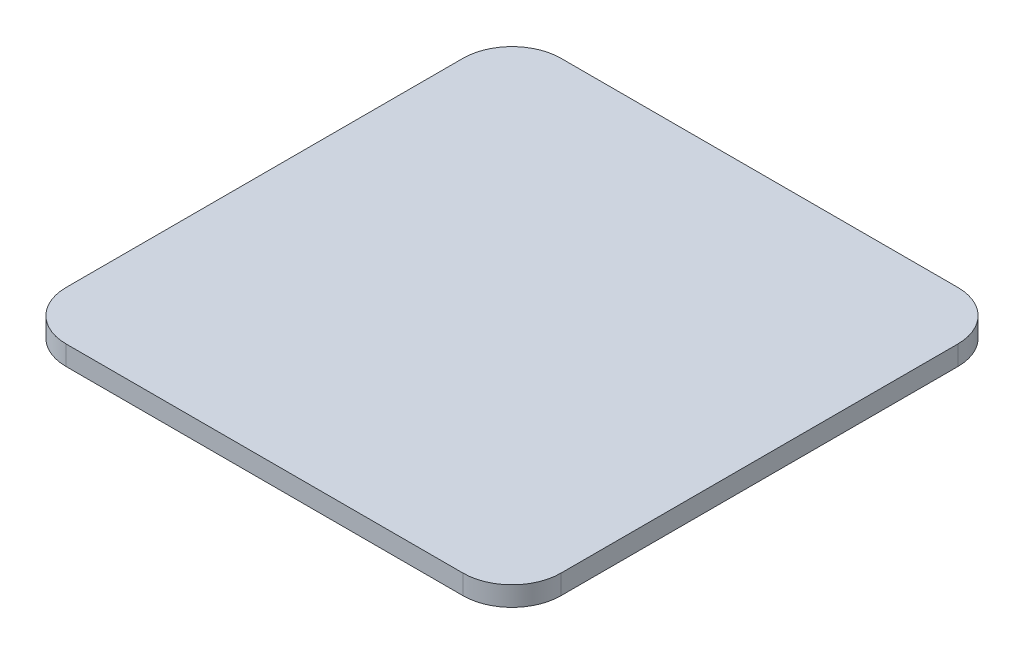
ISO-10303-21;
HEADER;
FILE_DESCRIPTION(('STEP AP214'),'2;1');
FILE_NAME('part.step','',(''),(''),'','','');
FILE_SCHEMA(('AUTOMOTIVE_DESIGN { 1 0 10303 214 1 1 1 1 }'));
ENDSEC;
DATA;
#1=APPLICATION_CONTEXT('core data for automotive mechanical design processes');
#2=APPLICATION_PROTOCOL_DEFINITION('international standard','automotive_design',2000,#1);
#3=PRODUCT_CONTEXT('',#1,'mechanical');
#4=PRODUCT('Part','Part','',(#3));
#5=PRODUCT_RELATED_PRODUCT_CATEGORY('part','',(#4));
#6=PRODUCT_DEFINITION_FORMATION('','',#4);
#7=PRODUCT_DEFINITION_CONTEXT('part definition',#1,'design');
#8=PRODUCT_DEFINITION('design','',#6,#7);
#9=PRODUCT_DEFINITION_SHAPE('','',#8);
#10=(LENGTH_UNIT() NAMED_UNIT(*) SI_UNIT(.MILLI.,.METRE.));
#11=(NAMED_UNIT(*) PLANE_ANGLE_UNIT() SI_UNIT($,.RADIAN.));
#12=(NAMED_UNIT(*) SI_UNIT($,.STERADIAN.) SOLID_ANGLE_UNIT());
#13=UNCERTAINTY_MEASURE_WITH_UNIT(LENGTH_MEASURE(1.E-05),#10,'distance_accuracy_value','');
#14=(GEOMETRIC_REPRESENTATION_CONTEXT(3) GLOBAL_UNCERTAINTY_ASSIGNED_CONTEXT((#13)) GLOBAL_UNIT_ASSIGNED_CONTEXT((#10,
#11,#12)) REPRESENTATION_CONTEXT('',''));
#15=CARTESIAN_POINT('',(0.,0.,0.));
#16=DIRECTION('',(0.,0.,1.));
#17=DIRECTION('',(1.,0.,0.));
#18=AXIS2_PLACEMENT_3D('',#15,#16,#17);
#19=CARTESIAN_POINT('',(-20.25,2.,20.25));
#20=DIRECTION('',(0.,-1.,0.));
#21=DIRECTION('',(0.,0.,-1.));
#22=AXIS2_PLACEMENT_3D('',#19,#20,#21);
#23=CYLINDRICAL_SURFACE('',#22,5.);
#24=CARTESIAN_POINT('',(-20.25,0.,20.25));
#25=DIRECTION('',(0.,1.,0.));
#26=DIRECTION('',(0.,0.,-1.));
#27=AXIS2_PLACEMENT_3D('',#24,#25,#26);
#28=CIRCLE('',#27,5.);
#29=CARTESIAN_POINT('',(-25.25,0.,20.25));
#30=VERTEX_POINT('',#29);
#31=CARTESIAN_POINT('',(-20.25,0.,25.25));
#32=VERTEX_POINT('',#31);
#33=EDGE_CURVE('E135',#30,#32,#28,.T.);
#34=ORIENTED_EDGE('',*,*,#33,.T.);
#35=DIRECTION('',(0.,-1.,0.));
#36=VECTOR('',#35,1.);
#37=CARTESIAN_POINT('',(-20.25,2.,25.25));
#38=LINE('',#37,#36);
#39=CARTESIAN_POINT('',(-20.25,2.,25.25));
#40=VERTEX_POINT('',#39);
#41=EDGE_CURVE('E11',#40,#32,#38,.T.);
#42=ORIENTED_EDGE('',*,*,#41,.F.);
#43=CARTESIAN_POINT('',(-20.25,2.,20.25));
#44=DIRECTION('',(0.,1.,0.));
#45=DIRECTION('',(0.,0.,-1.));
#46=AXIS2_PLACEMENT_3D('',#43,#44,#45);
#47=CIRCLE('',#46,5.);
#48=CARTESIAN_POINT('',(-25.25,2.,20.25));
#49=VERTEX_POINT('',#48);
#50=EDGE_CURVE('E149',#49,#40,#47,.T.);
#51=ORIENTED_EDGE('',*,*,#50,.F.);
#52=DIRECTION('',(0.,-1.,0.));
#53=VECTOR('',#52,1.);
#54=CARTESIAN_POINT('',(-25.25,2.,20.25));
#55=LINE('',#54,#53);
#56=EDGE_CURVE('E131',#49,#30,#55,.T.);
#57=ORIENTED_EDGE('',*,*,#56,.T.);
#58=EDGE_LOOP('',(#34,#42,#51,#57));
#59=FACE_BOUND('',#58,.T.);
#60=ADVANCED_FACE('F39',(#59),#23,.T.);
#61=CARTESIAN_POINT('',(-20.25,2.,25.25));
#62=DIRECTION('',(0.,0.,-1.));
#63=DIRECTION('',(-1.,0.,0.));
#64=AXIS2_PLACEMENT_3D('',#61,#62,#63);
#65=PLANE('',#64);
#66=DIRECTION('',(1.,0.,0.));
#67=VECTOR('',#66,1.);
#68=CARTESIAN_POINT('',(-20.25,0.,25.25));
#69=LINE('',#68,#67);
#70=CARTESIAN_POINT('',(20.25,0.,25.25));
#71=VERTEX_POINT('',#70);
#72=EDGE_CURVE('E138',#32,#71,#69,.T.);
#73=ORIENTED_EDGE('',*,*,#72,.T.);
#74=DIRECTION('',(0.,-1.,0.));
#75=VECTOR('',#74,1.);
#76=CARTESIAN_POINT('',(20.25,2.,25.25));
#77=LINE('',#76,#75);
#78=CARTESIAN_POINT('',(20.25,2.,25.25));
#79=VERTEX_POINT('',#78);
#80=EDGE_CURVE('E47',#79,#71,#77,.T.);
#81=ORIENTED_EDGE('',*,*,#80,.F.);
#82=DIRECTION('',(1.,0.,0.));
#83=VECTOR('',#82,1.);
#84=CARTESIAN_POINT('',(-20.25,2.,25.25));
#85=LINE('',#84,#83);
#86=EDGE_CURVE('E98',#40,#79,#85,.T.);
#87=ORIENTED_EDGE('',*,*,#86,.F.);
#88=ORIENTED_EDGE('',*,*,#41,.T.);
#89=EDGE_LOOP('',(#73,#81,#87,#88));
#90=FACE_BOUND('',#89,.T.);
#91=ADVANCED_FACE('F184',(#90),#65,.F.);
#92=CARTESIAN_POINT('',(20.25,2.,20.25));
#93=DIRECTION('',(0.,-1.,0.));
#94=DIRECTION('',(0.,0.,-1.));
#95=AXIS2_PLACEMENT_3D('',#92,#93,#94);
#96=CYLINDRICAL_SURFACE('',#95,5.);
#97=CARTESIAN_POINT('',(20.25,0.,20.25));
#98=DIRECTION('',(0.,1.,0.));
#99=DIRECTION('',(0.,0.,1.));
#100=AXIS2_PLACEMENT_3D('',#97,#98,#99);
#101=CIRCLE('',#100,5.);
#102=CARTESIAN_POINT('',(25.25,0.,20.25));
#103=VERTEX_POINT('',#102);
#104=EDGE_CURVE('E140',#71,#103,#101,.T.);
#105=ORIENTED_EDGE('',*,*,#104,.T.);
#106=DIRECTION('',(0.,-1.,0.));
#107=VECTOR('',#106,1.);
#108=CARTESIAN_POINT('',(25.25,2.,20.25));
#109=LINE('',#108,#107);
#110=CARTESIAN_POINT('',(25.25,2.,20.25));
#111=VERTEX_POINT('',#110);
#112=EDGE_CURVE('E156',#111,#103,#109,.T.);
#113=ORIENTED_EDGE('',*,*,#112,.F.);
#114=CARTESIAN_POINT('',(20.25,2.,20.25));
#115=DIRECTION('',(0.,1.,0.));
#116=DIRECTION('',(0.,0.,1.));
#117=AXIS2_PLACEMENT_3D('',#114,#115,#116);
#118=CIRCLE('',#117,5.);
#119=EDGE_CURVE('E164',#79,#111,#118,.T.);
#120=ORIENTED_EDGE('',*,*,#119,.F.);
#121=ORIENTED_EDGE('',*,*,#80,.T.);
#122=EDGE_LOOP('',(#105,#113,#120,#121));
#123=FACE_BOUND('',#122,.T.);
#124=ADVANCED_FACE('F162',(#123),#96,.T.);
#125=CARTESIAN_POINT('',(25.25,2.,-20.25));
#126=DIRECTION('',(-1.,0.,0.));
#127=DIRECTION('',(0.,0.,1.));
#128=AXIS2_PLACEMENT_3D('',#125,#126,#127);
#129=PLANE('',#128);
#130=DIRECTION('',(0.,0.,-1.));
#131=VECTOR('',#130,1.);
#132=CARTESIAN_POINT('',(25.25,0.,-20.25));
#133=LINE('',#132,#131);
#134=CARTESIAN_POINT('',(25.25,0.,-20.25));
#135=VERTEX_POINT('',#134);
#136=EDGE_CURVE('E142',#103,#135,#133,.T.);
#137=ORIENTED_EDGE('',*,*,#136,.T.);
#138=DIRECTION('',(0.,-1.,0.));
#139=VECTOR('',#138,1.);
#140=CARTESIAN_POINT('',(25.25,2.,-20.25));
#141=LINE('',#140,#139);
#142=CARTESIAN_POINT('',(25.25,2.,-20.25));
#143=VERTEX_POINT('',#142);
#144=EDGE_CURVE('E153',#143,#135,#141,.T.);
#145=ORIENTED_EDGE('',*,*,#144,.F.);
#146=DIRECTION('',(0.,0.,-1.));
#147=VECTOR('',#146,1.);
#148=CARTESIAN_POINT('',(25.25,2.,-20.25));
#149=LINE('',#148,#147);
#150=EDGE_CURVE('E176',#111,#143,#149,.T.);
#151=ORIENTED_EDGE('',*,*,#150,.F.);
#152=ORIENTED_EDGE('',*,*,#112,.T.);
#153=EDGE_LOOP('',(#137,#145,#151,#152));
#154=FACE_BOUND('',#153,.T.);
#155=ADVANCED_FACE('F172',(#154),#129,.F.);
#156=CARTESIAN_POINT('',(20.25,2.,-20.25));
#157=DIRECTION('',(0.,-1.,0.));
#158=DIRECTION('',(0.,0.,-1.));
#159=AXIS2_PLACEMENT_3D('',#156,#157,#158);
#160=CYLINDRICAL_SURFACE('',#159,5.);
#161=CARTESIAN_POINT('',(20.25,0.,-20.25));
#162=DIRECTION('',(0.,1.,0.));
#163=DIRECTION('',(0.,0.,1.));
#164=AXIS2_PLACEMENT_3D('',#161,#162,#163);
#165=CIRCLE('',#164,5.);
#166=CARTESIAN_POINT('',(20.25,0.,-25.25));
#167=VERTEX_POINT('',#166);
#168=EDGE_CURVE('E144',#135,#167,#165,.T.);
#169=ORIENTED_EDGE('',*,*,#168,.T.);
#170=DIRECTION('',(0.,-1.,0.));
#171=VECTOR('',#170,1.);
#172=CARTESIAN_POINT('',(20.25,2.,-25.25));
#173=LINE('',#172,#171);
#174=CARTESIAN_POINT('',(20.25,2.,-25.25));
#175=VERTEX_POINT('',#174);
#176=EDGE_CURVE('E126',#175,#167,#173,.T.);
#177=ORIENTED_EDGE('',*,*,#176,.F.);
#178=CARTESIAN_POINT('',(20.25,2.,-20.25));
#179=DIRECTION('',(0.,1.,0.));
#180=DIRECTION('',(0.,0.,1.));
#181=AXIS2_PLACEMENT_3D('',#178,#179,#180);
#182=CIRCLE('',#181,5.);
#183=EDGE_CURVE('E117',#143,#175,#182,.T.);
#184=ORIENTED_EDGE('',*,*,#183,.F.);
#185=ORIENTED_EDGE('',*,*,#144,.T.);
#186=EDGE_LOOP('',(#169,#177,#184,#185));
#187=FACE_BOUND('',#186,.T.);
#188=ADVANCED_FACE('F175',(#187),#160,.T.);
#189=CARTESIAN_POINT('',(-20.25,2.,-25.25));
#190=DIRECTION('',(0.,0.,1.));
#191=DIRECTION('',(1.,0.,0.));
#192=AXIS2_PLACEMENT_3D('',#189,#190,#191);
#193=PLANE('',#192);
#194=DIRECTION('',(-1.,0.,0.));
#195=VECTOR('',#194,1.);
#196=CARTESIAN_POINT('',(-20.25,0.,-25.25));
#197=LINE('',#196,#195);
#198=CARTESIAN_POINT('',(-20.25,0.,-25.25));
#199=VERTEX_POINT('',#198);
#200=EDGE_CURVE('E125',#167,#199,#197,.T.);
#201=ORIENTED_EDGE('',*,*,#200,.T.);
#202=DIRECTION('',(0.,-1.,0.));
#203=VECTOR('',#202,1.);
#204=CARTESIAN_POINT('',(-20.25,2.,-25.25));
#205=LINE('',#204,#203);
#206=CARTESIAN_POINT('',(-20.25,2.,-25.25));
#207=VERTEX_POINT('',#206);
#208=EDGE_CURVE('E122',#207,#199,#205,.T.);
#209=ORIENTED_EDGE('',*,*,#208,.F.);
#210=DIRECTION('',(-1.,0.,0.));
#211=VECTOR('',#210,1.);
#212=CARTESIAN_POINT('',(-20.25,2.,-25.25));
#213=LINE('',#212,#211);
#214=EDGE_CURVE('E111',#175,#207,#213,.T.);
#215=ORIENTED_EDGE('',*,*,#214,.F.);
#216=ORIENTED_EDGE('',*,*,#176,.T.);
#217=EDGE_LOOP('',(#201,#209,#215,#216));
#218=FACE_BOUND('',#217,.T.);
#219=ADVANCED_FACE('F123',(#218),#193,.F.);
#220=CARTESIAN_POINT('',(-20.25,2.,-20.25));
#221=DIRECTION('',(0.,-1.,0.));
#222=DIRECTION('',(0.,0.,-1.));
#223=AXIS2_PLACEMENT_3D('',#220,#221,#222);
#224=CYLINDRICAL_SURFACE('',#223,5.);
#225=CARTESIAN_POINT('',(-20.25,0.,-20.25));
#226=DIRECTION('',(0.,1.,0.));
#227=DIRECTION('',(0.,0.,1.));
#228=AXIS2_PLACEMENT_3D('',#225,#226,#227);
#229=CIRCLE('',#228,5.);
#230=CARTESIAN_POINT('',(-25.25,0.,-20.25));
#231=VERTEX_POINT('',#230);
#232=EDGE_CURVE('E84',#199,#231,#229,.T.);
#233=ORIENTED_EDGE('',*,*,#232,.T.);
#234=DIRECTION('',(0.,-1.,0.));
#235=VECTOR('',#234,1.);
#236=CARTESIAN_POINT('',(-25.25,2.,-20.25));
#237=LINE('',#236,#235);
#238=CARTESIAN_POINT('',(-25.25,2.,-20.25));
#239=VERTEX_POINT('',#238);
#240=EDGE_CURVE('E127',#239,#231,#237,.T.);
#241=ORIENTED_EDGE('',*,*,#240,.F.);
#242=CARTESIAN_POINT('',(-20.25,2.,-20.25));
#243=DIRECTION('',(0.,1.,0.));
#244=DIRECTION('',(0.,0.,1.));
#245=AXIS2_PLACEMENT_3D('',#242,#243,#244);
#246=CIRCLE('',#245,5.);
#247=EDGE_CURVE('E115',#207,#239,#246,.T.);
#248=ORIENTED_EDGE('',*,*,#247,.F.);
#249=ORIENTED_EDGE('',*,*,#208,.T.);
#250=EDGE_LOOP('',(#233,#241,#248,#249));
#251=FACE_BOUND('',#250,.T.);
#252=ADVANCED_FACE('F129',(#251),#224,.T.);
#253=CARTESIAN_POINT('',(-25.25,2.,-20.25));
#254=DIRECTION('',(1.,0.,0.));
#255=DIRECTION('',(0.,0.,-1.));
#256=AXIS2_PLACEMENT_3D('',#253,#254,#255);
#257=PLANE('',#256);
#258=DIRECTION('',(0.,0.,1.));
#259=VECTOR('',#258,1.);
#260=CARTESIAN_POINT('',(-25.25,0.,-20.25));
#261=LINE('',#260,#259);
#262=EDGE_CURVE('E90',#231,#30,#261,.T.);
#263=ORIENTED_EDGE('',*,*,#262,.T.);
#264=ORIENTED_EDGE('',*,*,#56,.F.);
#265=DIRECTION('',(0.,0.,1.));
#266=VECTOR('',#265,1.);
#267=CARTESIAN_POINT('',(-25.25,2.,-20.25));
#268=LINE('',#267,#266);
#269=EDGE_CURVE('E55',#239,#49,#268,.T.);
#270=ORIENTED_EDGE('',*,*,#269,.F.);
#271=ORIENTED_EDGE('',*,*,#240,.T.);
#272=EDGE_LOOP('',(#263,#264,#270,#271));
#273=FACE_BOUND('',#272,.T.);
#274=ADVANCED_FACE('F200',(#273),#257,.F.);
#275=CARTESIAN_POINT('',(-20.25,2.,20.25));
#276=DIRECTION('',(0.,-1.,0.));
#277=DIRECTION('',(0.,0.,-1.));
#278=AXIS2_PLACEMENT_3D('',#275,#276,#277);
#279=PLANE('',#278);
#280=ORIENTED_EDGE('',*,*,#50,.T.);
#281=ORIENTED_EDGE('',*,*,#86,.T.);
#282=ORIENTED_EDGE('',*,*,#119,.T.);
#283=ORIENTED_EDGE('',*,*,#150,.T.);
#284=ORIENTED_EDGE('',*,*,#183,.T.);
#285=ORIENTED_EDGE('',*,*,#214,.T.);
#286=ORIENTED_EDGE('',*,*,#247,.T.);
#287=ORIENTED_EDGE('',*,*,#269,.T.);
#288=EDGE_LOOP('',(#280,#281,#282,#283,#284,#285,#286,#287));
#289=FACE_BOUND('',#288,.T.);
#290=ADVANCED_FACE('F113',(#289),#279,.F.);
#291=CARTESIAN_POINT('',(-20.25,0.,20.25));
#292=DIRECTION('',(0.,-1.,0.));
#293=DIRECTION('',(0.,0.,-1.));
#294=AXIS2_PLACEMENT_3D('',#291,#292,#293);
#295=PLANE('',#294);
#296=ORIENTED_EDGE('',*,*,#33,.F.);
#297=ORIENTED_EDGE('',*,*,#262,.F.);
#298=ORIENTED_EDGE('',*,*,#232,.F.);
#299=ORIENTED_EDGE('',*,*,#200,.F.);
#300=ORIENTED_EDGE('',*,*,#168,.F.);
#301=ORIENTED_EDGE('',*,*,#136,.F.);
#302=ORIENTED_EDGE('',*,*,#104,.F.);
#303=ORIENTED_EDGE('',*,*,#72,.F.);
#304=EDGE_LOOP('',(#296,#297,#298,#299,#300,#301,#302,#303));
#305=FACE_BOUND('',#304,.T.);
#306=ADVANCED_FACE('F168',(#305),#295,.T.);
#307=CLOSED_SHELL('',(#60,#91,#124,#155,#188,#219,#252,#274,#290,#306));
#308=MANIFOLD_SOLID_BREP('B2',#307);
#309=ADVANCED_BREP_SHAPE_REPRESENTATION('',(#18,#308),#14);
#310=SHAPE_DEFINITION_REPRESENTATION(#9,#309);
ENDSEC;
END-ISO-10303-21;
